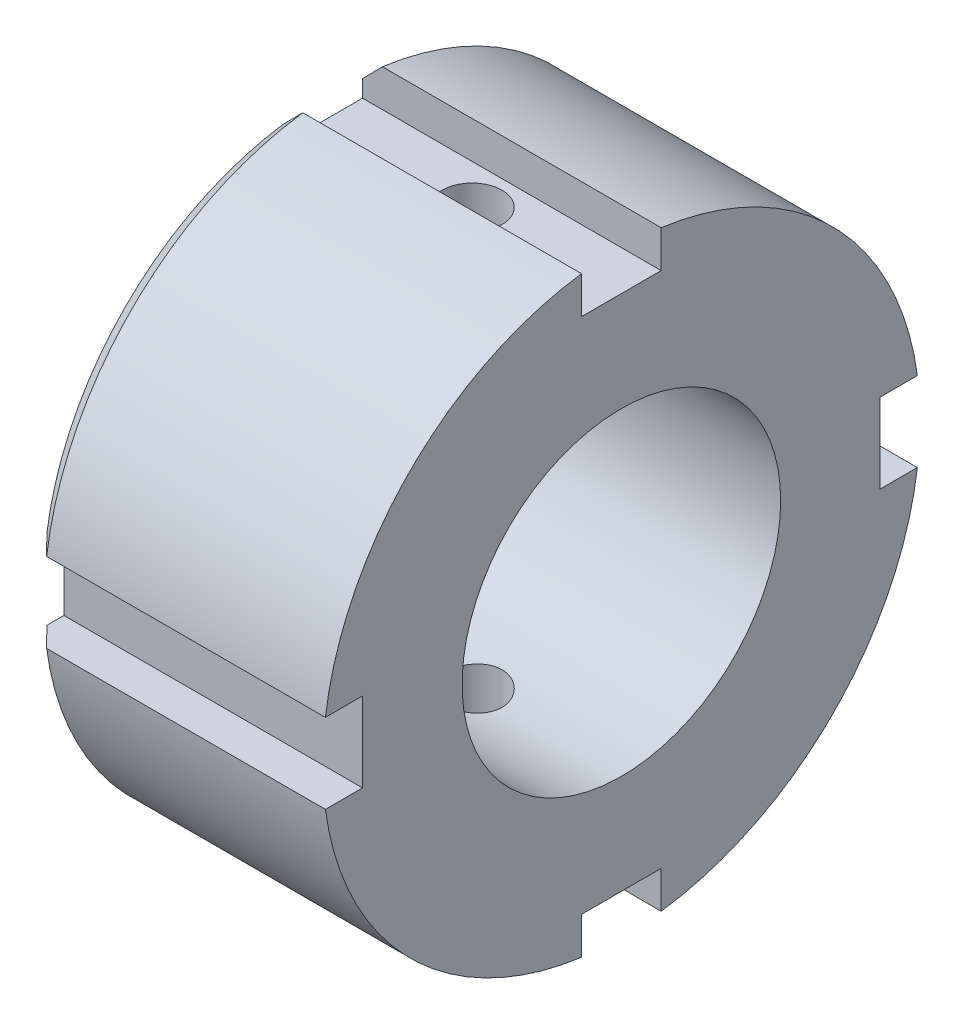
ISO-10303-21;
HEADER;
FILE_DESCRIPTION(('STEP AP214'),'2;1');
FILE_NAME('part.step','',(''),(''),'','','');
FILE_SCHEMA(('AUTOMOTIVE_DESIGN { 1 0 10303 214 1 1 1 1 }'));
ENDSEC;
DATA;
#1=APPLICATION_CONTEXT('core data for automotive mechanical design processes');
#2=APPLICATION_PROTOCOL_DEFINITION('international standard','automotive_design',2000,#1);
#3=PRODUCT_CONTEXT('',#1,'mechanical');
#4=PRODUCT('Part','Part','',(#3));
#5=PRODUCT_RELATED_PRODUCT_CATEGORY('part','',(#4));
#6=PRODUCT_DEFINITION_FORMATION('','',#4);
#7=PRODUCT_DEFINITION_CONTEXT('part definition',#1,'design');
#8=PRODUCT_DEFINITION('design','',#6,#7);
#9=PRODUCT_DEFINITION_SHAPE('','',#8);
#10=(LENGTH_UNIT() NAMED_UNIT(*) SI_UNIT(.MILLI.,.METRE.));
#11=(NAMED_UNIT(*) PLANE_ANGLE_UNIT() SI_UNIT($,.RADIAN.));
#12=(NAMED_UNIT(*) SI_UNIT($,.STERADIAN.) SOLID_ANGLE_UNIT());
#13=UNCERTAINTY_MEASURE_WITH_UNIT(LENGTH_MEASURE(1.E-05),#10,'distance_accuracy_value','');
#14=(GEOMETRIC_REPRESENTATION_CONTEXT(3) GLOBAL_UNCERTAINTY_ASSIGNED_CONTEXT((#13)) GLOBAL_UNIT_ASSIGNED_CONTEXT((#10,
#11,#12)) REPRESENTATION_CONTEXT('',''));
#15=CARTESIAN_POINT('',(0.,0.,0.));
#16=DIRECTION('',(0.,0.,1.));
#17=DIRECTION('',(1.,0.,0.));
#18=AXIS2_PLACEMENT_3D('',#15,#16,#17);
#19=CARTESIAN_POINT('',(0.,0.,0.));
#20=DIRECTION('',(1.,0.,0.));
#21=DIRECTION('',(0.,0.,-1.));
#22=AXIS2_PLACEMENT_3D('',#19,#20,#21);
#23=CYLINDRICAL_SURFACE('',#22,8.);
#24=CARTESIAN_POINT('',(0.,0.,0.));
#25=DIRECTION('',(1.,0.,0.));
#26=DIRECTION('',(0.,0.,-1.));
#27=AXIS2_PLACEMENT_3D('',#24,#25,#26);
#28=CIRCLE('',#27,8.);
#29=CARTESIAN_POINT('',(0.,0.,-8.));
#30=VERTEX_POINT('',#29);
#31=EDGE_CURVE('E344',#30,#30,#28,.T.);
#32=ORIENTED_EDGE('',*,*,#31,.F.);
#33=EDGE_LOOP('',(#32));
#34=FACE_BOUND('',#33,.T.);
#35=CARTESIAN_POINT('',(15.,0.,0.));
#36=DIRECTION('',(1.,0.,0.));
#37=DIRECTION('',(0.,0.,-1.));
#38=AXIS2_PLACEMENT_3D('',#35,#36,#37);
#39=CIRCLE('',#38,8.);
#40=CARTESIAN_POINT('',(15.,0.,-8.));
#41=VERTEX_POINT('',#40);
#42=EDGE_CURVE('E343',#41,#41,#39,.T.);
#43=ORIENTED_EDGE('',*,*,#42,.T.);
#44=EDGE_LOOP('',(#43));
#45=FACE_BOUND('',#44,.T.);
#46=CARTESIAN_POINT('',(7.5,-7.85811682275086,-1.5));
#47=CARTESIAN_POINT('',(7.41654279198826,-7.85811843793493,-1.49999679883246));
#48=CARTESIAN_POINT('',(7.33304405178161,-7.85946079760266,-1.49301126348936));
#49=CARTESIAN_POINT('',(7.16840103841809,-7.86467851014364,-1.46527253251805));
#50=CARTESIAN_POINT('',(7.08725882357252,-7.86855601173205,-1.44450765768477));
#51=CARTESIAN_POINT('',(6.92973492862912,-7.87838976464885,-1.38987035617788));
#52=CARTESIAN_POINT('',(6.85334889069271,-7.88434407905997,-1.35601013954374));
#53=CARTESIAN_POINT('',(6.70734644071319,-7.89765826320959,-1.27617565760366));
#54=CARTESIAN_POINT('',(6.6377295009967,-7.90501802325622,-1.23020233759193));
#55=CARTESIAN_POINT('',(6.50636980080087,-7.92041614838944,-1.12683678942623));
#56=CARTESIAN_POINT('',(6.44472351652827,-7.92846116625679,-1.06932292933092));
#57=CARTESIAN_POINT('',(6.33189561040044,-7.94426457664034,-0.944771778803554));
#58=CARTESIAN_POINT('',(6.28071467557521,-7.95202295031153,-0.877733863624947));
#59=CARTESIAN_POINT('',(6.18990062339948,-7.96645017828405,-0.735403894570165));
#60=CARTESIAN_POINT('',(6.15035846648058,-7.97311028052363,-0.660052840033868));
#61=CARTESIAN_POINT('',(6.08453045772647,-7.9845160863293,-0.503631283250765));
#62=CARTESIAN_POINT('',(6.05824351600978,-7.98926194728334,-0.422561251859508));
#63=CARTESIAN_POINT('',(6.01997045138887,-7.99625755123778,-0.258002746187419));
#64=CARTESIAN_POINT('',(6.00782169407731,-7.99853565976327,-0.17455332324486));
#65=CARTESIAN_POINT('',(5.9976631122996,-8.00043684615594,-0.00677167603538572));
#66=CARTESIAN_POINT('',(5.99965208386094,-8.00006015010697,0.0775604724476677));
#67=CARTESIAN_POINT('',(6.01758777114715,-7.99671633763241,0.243598357899394));
#68=CARTESIAN_POINT('',(6.03335936943001,-7.99378172247214,0.325323760451467));
#69=CARTESIAN_POINT('',(6.07813564939524,-7.98568826333561,0.484947165715473));
#70=CARTESIAN_POINT('',(6.1071408133458,-7.98052933829966,0.562845028826538));
#71=CARTESIAN_POINT('',(6.1777277310583,-7.96851260297339,0.713110065751519));
#72=CARTESIAN_POINT('',(6.2193794879125,-7.96164537590825,0.785443571838531));
#73=CARTESIAN_POINT('',(6.31402566907715,-7.9469714754285,0.922159977214636));
#74=CARTESIAN_POINT('',(6.36702124688758,-7.93916470651164,0.986542066910783));
#75=CARTESIAN_POINT('',(6.48381570298353,-7.92333513680567,1.10656561896904));
#76=CARTESIAN_POINT('',(6.54776778390207,-7.91531085901622,1.16205790757041));
#77=CARTESIAN_POINT('',(6.68414953127862,-7.90006508924621,1.2615517185126));
#78=CARTESIAN_POINT('',(6.75657932176463,-7.89284360901351,1.30555307271182));
#79=CARTESIAN_POINT('',(6.90805827070266,-7.88001893307121,1.38085852224477));
#80=CARTESIAN_POINT('',(6.98711845719064,-7.87441850530261,1.41214093645421));
#81=CARTESIAN_POINT('',(7.1495011841232,-7.86551242396689,1.46093656975056));
#82=CARTESIAN_POINT('',(7.23282324046478,-7.8622065103862,1.47845134901108));
#83=CARTESIAN_POINT('',(7.40001932885588,-7.85831520301005,1.49899672649739));
#84=CARTESIAN_POINT('',(7.48386611556551,-7.85768955816137,1.50224164285859));
#85=CARTESIAN_POINT('',(7.65090345508715,-7.8591219142084,1.49472968881724));
#86=CARTESIAN_POINT('',(7.73409404014808,-7.86117978238611,1.48397351086433));
#87=CARTESIAN_POINT('',(7.89675290305439,-7.86770980063205,1.44894868195882));
#88=CARTESIAN_POINT('',(7.97624625262489,-7.87216186690878,1.42479238583989));
#89=CARTESIAN_POINT('',(8.13005718973016,-7.88296134156619,1.3637722437906));
#90=CARTESIAN_POINT('',(8.20437439531533,-7.88930888963281,1.32690746128795));
#91=CARTESIAN_POINT('',(8.34666761904317,-7.90327577863685,1.2410235311966));
#92=CARTESIAN_POINT('',(8.41456053786607,-7.91090895425315,1.19186899639621));
#93=CARTESIAN_POINT('',(8.54121204021433,-7.926548113681,1.08298344344246));
#94=CARTESIAN_POINT('',(8.59996980155577,-7.93455413096494,1.02325147433084));
#95=CARTESIAN_POINT('',(8.70748376353412,-7.95016624005946,0.893949417870385));
#96=CARTESIAN_POINT('',(8.75609582660596,-7.95776555833305,0.82425853409589));
#97=CARTESIAN_POINT('',(8.84092120617766,-7.97159404810351,0.677574523040139));
#98=CARTESIAN_POINT('',(8.877135000025,-7.97782327234725,0.600581677038528));
#99=CARTESIAN_POINT('',(8.93592009786408,-7.98818057995848,0.441877541578683));
#100=CARTESIAN_POINT('',(8.95856218756141,-7.99231954730142,0.360193213078987));
#101=CARTESIAN_POINT('',(8.98978704828989,-7.99807642083745,0.194096227381569));
#102=CARTESIAN_POINT('',(8.99837129866271,-7.99969459229933,0.10968385821585));
#103=CARTESIAN_POINT('',(9.00118530151844,-8.00022227515441,-0.0580907602505103));
#104=CARTESIAN_POINT('',(8.99563275312953,-7.99917286625032,-0.141449307066269));
#105=CARTESIAN_POINT('',(8.97080757223156,-7.99456866611703,-0.306023369279201));
#106=CARTESIAN_POINT('',(8.95153507125579,-7.99101389890671,-0.38723890521369));
#107=CARTESIAN_POINT('',(8.89990879261628,-7.98179837978045,-0.545106475595486));
#108=CARTESIAN_POINT('',(8.86757818711899,-7.97614135981576,-0.621766319318225));
#109=CARTESIAN_POINT('',(8.79077954634482,-7.96333372068771,-0.768605631316696));
#110=CARTESIAN_POINT('',(8.74631069789335,-7.95618300146483,-0.838784665003272));
#111=CARTESIAN_POINT('',(8.64574854555768,-7.94104779859941,-0.971755027780007));
#112=CARTESIAN_POINT('',(8.5894979661383,-7.93305284591272,-1.03442623539053));
#113=CARTESIAN_POINT('',(8.4672954375073,-7.91719633538833,-1.14951536065485));
#114=CARTESIAN_POINT('',(8.40134120962628,-7.90933480936765,-1.2019308632478));
#115=CARTESIAN_POINT('',(8.26087354529666,-7.89455577425926,-1.29547633945385));
#116=CARTESIAN_POINT('',(8.18628656033236,-7.88764767280729,-1.33649740531872));
#117=CARTESIAN_POINT('',(8.03117421002026,-7.87567084650033,-1.40536132423417));
#118=CARTESIAN_POINT('',(7.95065453341062,-7.87060038649116,-1.43321661638912));
#119=CARTESIAN_POINT('',(7.80824771193409,-7.86393016292125,-1.46929726596176));
#120=CARTESIAN_POINT('',(7.74719427623806,-7.86176310717932,-1.48079105739851));
#121=CARTESIAN_POINT('',(7.62410153157968,-7.85885585595504,-1.49614351076215));
#122=CARTESIAN_POINT('',(7.56206224949967,-7.85811562163283,-1.50000238052127));
#123=CARTESIAN_POINT('',(7.5,-7.85811682275086,-1.5));
#124=B_SPLINE_CURVE_WITH_KNOTS('',3,(#46,#47,#48,#49,#50,#51,#52,#53,#54,#55,#56,#57,#58,#59,
#60,#61,#62,#63,#64,#65,#66,#67,#68,#69,#70,#71,#72,#73,#74,#75,#76,#77,#78,#79,#80,#81,#82,#83,
#84,#85,#86,#87,#88,#89,#90,#91,#92,#93,#94,#95,#96,#97,#98,#99,#100,#101,#102,#103,#104,#105,
#106,#107,#108,#109,#110,#111,#112,#113,#114,#115,#116,#117,#118,#119,#120,#121,#122,#123),
.UNSPECIFIED.,.T.,.F.,(4,2,2,2,2,2,2,2,2,2,2,2,2,2,2,2,2,2,2,2,2,2,2,2,2,2,2,2,2,2,2,2,2,2,2,2,
2,2,4),(0.,0.250144505793186,0.500501302380392,0.750625227978432,1.00072963993908,
1.25362335698691,1.50653367069315,1.76137104348047,2.0161874593964,2.26804275460261,
2.51987660200648,2.76855650598724,3.01724547328424,3.26733691984219,3.51745380911785,
3.77140614764064,4.025362201924,4.27974936118266,4.53410768866488,4.78463248587075,
5.03514489338718,5.28358792315369,5.53204926624317,5.78337862654144,6.03473059394677,
6.28944125495871,6.54414210821705,6.79750269418683,7.0508366166733,7.30029300570138,
7.54974700322167,7.79876026530358,8.0477902135711,8.30038464008744,8.55303847730764,
8.80803001818118,9.06278015749119,9.24880307527214,9.43482092920425),.UNSPECIFIED.);
#125=CARTESIAN_POINT('',(7.5,-7.85811682275086,-1.5));
#126=VERTEX_POINT('',#125);
#127=EDGE_CURVE('E405',#126,#126,#124,.T.);
#128=ORIENTED_EDGE('',*,*,#127,.F.);
#129=EDGE_LOOP('',(#128));
#130=FACE_BOUND('',#129,.T.);
#131=CARTESIAN_POINT('',(7.5,7.85811682275086,-1.5));
#132=CARTESIAN_POINT('',(7.58345720801174,7.85811843793493,-1.49999679883246));
#133=CARTESIAN_POINT('',(7.66695594821839,7.85946079760266,-1.49301126348936));
#134=CARTESIAN_POINT('',(7.83159896158191,7.86467851014364,-1.46527253251805));
#135=CARTESIAN_POINT('',(7.91274117642748,7.86855601173205,-1.44450765768477));
#136=CARTESIAN_POINT('',(8.07026507137087,7.87838976464885,-1.38987035617788));
#137=CARTESIAN_POINT('',(8.14665110930729,7.88434407905997,-1.35601013954374));
#138=CARTESIAN_POINT('',(8.29265355928681,7.89765826320959,-1.27617565760366));
#139=CARTESIAN_POINT('',(8.3622704990033,7.90501802325622,-1.23020233759193));
#140=CARTESIAN_POINT('',(8.49363019919913,7.92041614838944,-1.12683678942623));
#141=CARTESIAN_POINT('',(8.55527648347173,7.92846116625679,-1.06932292933092));
#142=CARTESIAN_POINT('',(8.66810438959956,7.94426457664034,-0.944771778803554));
#143=CARTESIAN_POINT('',(8.71928532442479,7.95202295031153,-0.877733863624948));
#144=CARTESIAN_POINT('',(8.81009937660052,7.96645017828405,-0.735403894570166));
#145=CARTESIAN_POINT('',(8.84964153351942,7.97311028052363,-0.660052840033869));
#146=CARTESIAN_POINT('',(8.91546954227353,7.9845160863293,-0.503631283250765));
#147=CARTESIAN_POINT('',(8.94175648399022,7.98926194728334,-0.422561251859508));
#148=CARTESIAN_POINT('',(8.98002954861113,7.99625755123778,-0.258002746187419));
#149=CARTESIAN_POINT('',(8.99217830592269,7.99853565976327,-0.17455332324486));
#150=CARTESIAN_POINT('',(9.0023368877004,8.00043684615594,-0.00677167603538552));
#151=CARTESIAN_POINT('',(9.00034791613906,8.00006015010697,0.0775604724476677));
#152=CARTESIAN_POINT('',(8.98241222885285,7.99671633763241,0.243598357899394));
#153=CARTESIAN_POINT('',(8.96664063056999,7.99378172247214,0.325323760451467));
#154=CARTESIAN_POINT('',(8.92186435060476,7.98568826333561,0.484947165715473));
#155=CARTESIAN_POINT('',(8.8928591866542,7.98052933829966,0.562845028826538));
#156=CARTESIAN_POINT('',(8.8222722689417,7.96851260297339,0.713110065751519));
#157=CARTESIAN_POINT('',(8.7806205120875,7.96164537590826,0.78544357183853));
#158=CARTESIAN_POINT('',(8.68597433092285,7.9469714754285,0.922159977214635));
#159=CARTESIAN_POINT('',(8.63297875311242,7.93916470651164,0.986542066910783));
#160=CARTESIAN_POINT('',(8.51618429701647,7.92333513680567,1.10656561896904));
#161=CARTESIAN_POINT('',(8.45223221609793,7.91531085901622,1.16205790757041));
#162=CARTESIAN_POINT('',(8.31585046872138,7.90006508924621,1.2615517185126));
#163=CARTESIAN_POINT('',(8.24342067823537,7.89284360901351,1.30555307271182));
#164=CARTESIAN_POINT('',(8.09194172929734,7.88001893307121,1.38085852224477));
#165=CARTESIAN_POINT('',(8.01288154280936,7.87441850530261,1.41214093645421));
#166=CARTESIAN_POINT('',(7.8504988158768,7.86551242396689,1.46093656975056));
#167=CARTESIAN_POINT('',(7.76717675953522,7.8622065103862,1.47845134901108));
#168=CARTESIAN_POINT('',(7.59998067114412,7.85831520301005,1.49899672649739));
#169=CARTESIAN_POINT('',(7.51613388443449,7.85768955816137,1.50224164285858));
#170=CARTESIAN_POINT('',(7.34909654491285,7.8591219142084,1.49472968881724));
#171=CARTESIAN_POINT('',(7.26590595985192,7.86117978238611,1.48397351086433));
#172=CARTESIAN_POINT('',(7.10324709694561,7.86770980063205,1.44894868195883));
#173=CARTESIAN_POINT('',(7.02375374737511,7.87216186690878,1.4247923858399));
#174=CARTESIAN_POINT('',(6.86994281026984,7.88296134156619,1.3637722437906));
#175=CARTESIAN_POINT('',(6.79562560468467,7.88930888963281,1.32690746128795));
#176=CARTESIAN_POINT('',(6.65333238095683,7.90327577863685,1.2410235311966));
#177=CARTESIAN_POINT('',(6.58543946213393,7.91090895425315,1.19186899639621));
#178=CARTESIAN_POINT('',(6.45878795978567,7.926548113681,1.08298344344247));
#179=CARTESIAN_POINT('',(6.40003019844423,7.93455413096494,1.02325147433084));
#180=CARTESIAN_POINT('',(6.29251623646587,7.95016624005946,0.893949417870385));
#181=CARTESIAN_POINT('',(6.24390417339403,7.95776555833305,0.82425853409589));
#182=CARTESIAN_POINT('',(6.15907879382234,7.97159404810351,0.67757452304014));
#183=CARTESIAN_POINT('',(6.122864999975,7.97782327234725,0.600581677038528));
#184=CARTESIAN_POINT('',(6.06407990213592,7.98818057995848,0.441877541578684));
#185=CARTESIAN_POINT('',(6.04143781243859,7.99231954730142,0.360193213078987));
#186=CARTESIAN_POINT('',(6.01021295171011,7.99807642083745,0.19409622738157));
#187=CARTESIAN_POINT('',(6.00162870133729,7.99969459229933,0.10968385821585));
#188=CARTESIAN_POINT('',(5.99881469848156,8.00022227515441,-0.0580907602505096));
#189=CARTESIAN_POINT('',(6.00436724687047,7.99917286625032,-0.141449307066269));
#190=CARTESIAN_POINT('',(6.02919242776843,7.99456866611703,-0.3060233692792));
#191=CARTESIAN_POINT('',(6.04846492874421,7.99101389890671,-0.38723890521369));
#192=CARTESIAN_POINT('',(6.10009120738372,7.98179837978045,-0.545106475595485));
#193=CARTESIAN_POINT('',(6.13242181288101,7.97614135981576,-0.621766319318224));
#194=CARTESIAN_POINT('',(6.20922045365518,7.96333372068771,-0.768605631316694));
#195=CARTESIAN_POINT('',(6.25368930210665,7.95618300146483,-0.838784665003271));
#196=CARTESIAN_POINT('',(6.35425145444232,7.94104779859941,-0.971755027780007));
#197=CARTESIAN_POINT('',(6.4105020338617,7.93305284591272,-1.03442623539053));
#198=CARTESIAN_POINT('',(6.5327045624927,7.91719633538833,-1.14951536065485));
#199=CARTESIAN_POINT('',(6.59865879037372,7.90933480936765,-1.2019308632478));
#200=CARTESIAN_POINT('',(6.73912645470334,7.89455577425926,-1.29547633945385));
#201=CARTESIAN_POINT('',(6.81371343966764,7.88764767280729,-1.33649740531872));
#202=CARTESIAN_POINT('',(6.96882578997974,7.87567084650033,-1.40536132423417));
#203=CARTESIAN_POINT('',(7.04934546658938,7.87060038649116,-1.43321661638912));
#204=CARTESIAN_POINT('',(7.19175228806591,7.86393016292125,-1.46929726596176));
#205=CARTESIAN_POINT('',(7.25280572376194,7.86176310717932,-1.48079105739851));
#206=CARTESIAN_POINT('',(7.37589846842031,7.85885585595504,-1.49614351076215));
#207=CARTESIAN_POINT('',(7.43793775050033,7.85811562163283,-1.50000238052127));
#208=CARTESIAN_POINT('',(7.5,7.85811682275086,-1.5));
#209=B_SPLINE_CURVE_WITH_KNOTS('',3,(#131,#132,#133,#134,#135,#136,#137,#138,#139,#140,#141,
#142,#143,#144,#145,#146,#147,#148,#149,#150,#151,#152,#153,#154,#155,#156,#157,#158,#159,#160,
#161,#162,#163,#164,#165,#166,#167,#168,#169,#170,#171,#172,#173,#174,#175,#176,#177,#178,#179,
#180,#181,#182,#183,#184,#185,#186,#187,#188,#189,#190,#191,#192,#193,#194,#195,#196,#197,#198,
#199,#200,#201,#202,#203,#204,#205,#206,#207,#208),.UNSPECIFIED.,.T.,.F.,(4,2,2,2,2,2,2,2,2,2,2,
2,2,2,2,2,2,2,2,2,2,2,2,2,2,2,2,2,2,2,2,2,2,2,2,2,2,2,4),(0.,0.250144505793186,
0.500501302380392,0.750625227978432,1.00072963993908,1.25362335698691,1.50653367069315,
1.76137104348047,2.0161874593964,2.26804275460261,2.51987660200648,2.76855650598724,
3.01724547328424,3.26733691984219,3.51745380911785,3.77140614764064,4.025362201924,
4.27974936118266,4.53410768866488,4.78463248587075,5.03514489338718,5.28358792315368,
5.53204926624317,5.78337862654143,6.03473059394677,6.28944125495871,6.54414210821705,
6.79750269418683,7.0508366166733,7.30029300570138,7.54974700322167,7.79876026530358,
8.0477902135711,8.30038464008745,8.55303847730765,8.80803001818118,9.06278015749119,
9.24880307527214,9.43482092920425),.UNSPECIFIED.);
#210=CARTESIAN_POINT('',(7.5,7.85811682275086,-1.5));
#211=VERTEX_POINT('',#210);
#212=EDGE_CURVE('E271',#211,#211,#209,.T.);
#213=ORIENTED_EDGE('',*,*,#212,.F.);
#214=EDGE_LOOP('',(#213));
#215=FACE_BOUND('',#214,.T.);
#216=ADVANCED_FACE('F45',(#34,#45,#130,#215),#23,.F.);
#217=CARTESIAN_POINT('',(15.,0.,0.));
#218=DIRECTION('',(-1.,0.,0.));
#219=DIRECTION('',(0.,0.,1.));
#220=AXIS2_PLACEMENT_3D('',#217,#218,#219);
#221=CYLINDRICAL_SURFACE('',#220,15.);
#222=CARTESIAN_POINT('',(1.,0.,0.));
#223=DIRECTION('',(1.,0.,0.));
#224=DIRECTION('',(0.,0.,-1.));
#225=AXIS2_PLACEMENT_3D('',#222,#223,#224);
#226=CIRCLE('',#225,15.);
#227=CARTESIAN_POINT('',(1.,14.8660687473185,2.));
#228=VERTEX_POINT('',#227);
#229=CARTESIAN_POINT('',(1.,1.99999999999995,14.8660687473185));
#230=VERTEX_POINT('',#229);
#231=EDGE_CURVE('E358',#228,#230,#226,.T.);
#232=ORIENTED_EDGE('',*,*,#231,.T.);
#233=DIRECTION('',(-1.,0.,0.));
#234=VECTOR('',#233,1.);
#235=CARTESIAN_POINT('',(15.,1.99999999999995,14.8660687473185));
#236=LINE('',#235,#234);
#237=CARTESIAN_POINT('',(15.,1.99999999999995,14.8660687473185));
#238=VERTEX_POINT('',#237);
#239=EDGE_CURVE('E301',#230,#238,#236,.F.);
#240=ORIENTED_EDGE('',*,*,#239,.T.);
#241=CARTESIAN_POINT('',(15.,0.,0.));
#242=DIRECTION('',(1.,0.,0.));
#243=DIRECTION('',(0.,0.,-1.));
#244=AXIS2_PLACEMENT_3D('',#241,#242,#243);
#245=CIRCLE('',#244,15.);
#246=CARTESIAN_POINT('',(15.,14.8660687473185,2.));
#247=VERTEX_POINT('',#246);
#248=EDGE_CURVE('E352',#247,#238,#245,.T.);
#249=ORIENTED_EDGE('',*,*,#248,.F.);
#250=DIRECTION('',(-1.,0.,0.));
#251=VECTOR('',#250,1.);
#252=CARTESIAN_POINT('',(15.,14.8660687473185,2.));
#253=LINE('',#252,#251);
#254=EDGE_CURVE('E332',#247,#228,#253,.T.);
#255=ORIENTED_EDGE('',*,*,#254,.T.);
#256=EDGE_LOOP('',(#232,#240,#249,#255));
#257=FACE_BOUND('',#256,.T.);
#258=ADVANCED_FACE('F399',(#257),#221,.T.);
#259=CARTESIAN_POINT('',(15.,-2.00000000000005,14.8660687473185));
#260=VERTEX_POINT('',#259);
#261=CARTESIAN_POINT('',(15.,-14.8660687473185,2.));
#262=VERTEX_POINT('',#261);
#263=EDGE_CURVE('E357',#260,#262,#245,.T.);
#264=ORIENTED_EDGE('',*,*,#263,.F.);
#265=DIRECTION('',(-1.,0.,0.));
#266=VECTOR('',#265,1.);
#267=CARTESIAN_POINT('',(15.,-2.00000000000005,14.8660687473185));
#268=LINE('',#267,#266);
#269=CARTESIAN_POINT('',(1.,-2.00000000000005,14.8660687473185));
#270=VERTEX_POINT('',#269);
#271=EDGE_CURVE('E297',#260,#270,#268,.T.);
#272=ORIENTED_EDGE('',*,*,#271,.T.);
#273=CARTESIAN_POINT('',(1.,-14.8660687473185,2.));
#274=VERTEX_POINT('',#273);
#275=EDGE_CURVE('E363',#270,#274,#226,.T.);
#276=ORIENTED_EDGE('',*,*,#275,.T.);
#277=DIRECTION('',(-1.,0.,0.));
#278=VECTOR('',#277,1.);
#279=CARTESIAN_POINT('',(15.,-14.8660687473185,2.));
#280=LINE('',#279,#278);
#281=EDGE_CURVE('E293',#274,#262,#280,.F.);
#282=ORIENTED_EDGE('',*,*,#281,.T.);
#283=EDGE_LOOP('',(#264,#272,#276,#282));
#284=FACE_BOUND('',#283,.T.);
#285=ADVANCED_FACE('F554',(#284),#221,.T.);
#286=CARTESIAN_POINT('',(15.,-14.8660687473185,-2.));
#287=VERTEX_POINT('',#286);
#288=CARTESIAN_POINT('',(15.,-1.99999999999985,-14.8660687473185));
#289=VERTEX_POINT('',#288);
#290=EDGE_CURVE('E501',#287,#289,#245,.T.);
#291=ORIENTED_EDGE('',*,*,#290,.F.);
#292=DIRECTION('',(-1.,0.,0.));
#293=VECTOR('',#292,1.);
#294=CARTESIAN_POINT('',(15.,-14.8660687473185,-2.));
#295=LINE('',#294,#293);
#296=CARTESIAN_POINT('',(1.,-14.8660687473185,-2.));
#297=VERTEX_POINT('',#296);
#298=EDGE_CURVE('E289',#287,#297,#295,.T.);
#299=ORIENTED_EDGE('',*,*,#298,.T.);
#300=CARTESIAN_POINT('',(1.,-1.99999999999985,-14.8660687473185));
#301=VERTEX_POINT('',#300);
#302=EDGE_CURVE('E499',#297,#301,#226,.T.);
#303=ORIENTED_EDGE('',*,*,#302,.T.);
#304=DIRECTION('',(-1.,0.,0.));
#305=VECTOR('',#304,1.);
#306=CARTESIAN_POINT('',(15.,-1.99999999999985,-14.8660687473185));
#307=LINE('',#306,#305);
#308=EDGE_CURVE('E285',#301,#289,#307,.F.);
#309=ORIENTED_EDGE('',*,*,#308,.T.);
#310=EDGE_LOOP('',(#291,#299,#303,#309));
#311=FACE_BOUND('',#310,.T.);
#312=ADVANCED_FACE('F498',(#311),#221,.T.);
#313=CARTESIAN_POINT('',(1.,0.,0.));
#314=DIRECTION('',(1.,0.,0.));
#315=DIRECTION('',(0.,0.,-1.));
#316=AXIS2_PLACEMENT_3D('',#313,#314,#315);
#317=CONICAL_SURFACE('',#316,15.,0.78539816339745);
#318=CARTESIAN_POINT('',(3.23626797749979,1.99999999999994,17.1198403553358));
#319=CARTESIAN_POINT('',(2.77949257358208,1.99999999999994,16.6599502143616));
#320=CARTESIAN_POINT('',(2.32283355598238,1.99999999999995,16.199944379221));
#321=CARTESIAN_POINT('',(1.40983903079534,1.99999999999995,15.2796126300725));
#322=CARTESIAN_POINT('',(0.95350352291392,1.99999999999995,14.8192867163562));
#323=CARTESIAN_POINT('',(0.041245708928601,1.99999999999995,13.8982250668306));
#324=CARTESIAN_POINT('',(-0.414676596981592,1.99999999999996,13.4374893308294));
#325=CARTESIAN_POINT('',(-1.32594517655886,1.99999999999996,12.5154477831824));
#326=CARTESIAN_POINT('',(-1.78129144969422,1.99999999999996,12.0541419710112));
#327=CARTESIAN_POINT('',(-2.23626797749978,1.99999999999996,11.5924713110362));
#328=B_SPLINE_CURVE_WITH_KNOTS('',3,(#318,#319,#320,#321,#322,#323,#324,#325,#326,#327),
.UNSPECIFIED.,.F.,.F.,(4,2,2,2,4),(0.,1.94455256503318,3.88910336001572,5.8336550660895,
7.77820856578055),.UNSPECIFIED.);
#329=CARTESIAN_POINT('',(0.,1.99999999999995,13.856406460551));
#330=VERTEX_POINT('',#329);
#331=EDGE_CURVE('E11',#230,#330,#328,.T.);
#332=ORIENTED_EDGE('',*,*,#331,.F.);
#333=ORIENTED_EDGE('',*,*,#231,.F.);
#334=CARTESIAN_POINT('',(-2.23626797749979,11.5924713110362,2.));
#335=CARTESIAN_POINT('',(-1.78129144969423,12.0541419710112,2.));
#336=CARTESIAN_POINT('',(-1.32594517655886,12.5154477831824,2.));
#337=CARTESIAN_POINT('',(-0.414676596981595,13.4374893308294,2.));
#338=CARTESIAN_POINT('',(0.0412457089285992,13.8982250668306,2.));
#339=CARTESIAN_POINT('',(0.953503522913919,14.8192867163562,2.));
#340=CARTESIAN_POINT('',(1.40983903079535,15.2796126300725,2.));
#341=CARTESIAN_POINT('',(2.32283355598238,16.199944379221,2.));
#342=CARTESIAN_POINT('',(2.77949257358209,16.6599502143616,2.));
#343=CARTESIAN_POINT('',(3.23626797749979,17.1198403553358,2.));
#344=B_SPLINE_CURVE_WITH_KNOTS('',3,(#334,#335,#336,#337,#338,#339,#340,#341,#342,#343),
.UNSPECIFIED.,.F.,.F.,(4,2,2,2,4),(0.,1.94455349969105,3.88910520576483,5.83365600074738,
7.77820856578056),.UNSPECIFIED.);
#345=CARTESIAN_POINT('',(0.,13.856406460551,2.));
#346=VERTEX_POINT('',#345);
#347=EDGE_CURVE('E368',#346,#228,#344,.T.);
#348=ORIENTED_EDGE('',*,*,#347,.F.);
#349=CARTESIAN_POINT('',(0.,0.,0.));
#350=DIRECTION('',(1.,0.,0.));
#351=DIRECTION('',(0.,0.,-1.));
#352=AXIS2_PLACEMENT_3D('',#349,#350,#351);
#353=CIRCLE('',#352,14.);
#354=EDGE_CURVE('E362',#330,#346,#353,.F.);
#355=ORIENTED_EDGE('',*,*,#354,.F.);
#356=EDGE_LOOP('',(#332,#333,#348,#355));
#357=FACE_BOUND('',#356,.T.);
#358=ADVANCED_FACE('F529',(#357),#317,.T.);
#359=CARTESIAN_POINT('',(-2.2362679774998,-2.00000000000004,11.5924713110362));
#360=CARTESIAN_POINT('',(-1.78129144969423,-2.00000000000004,12.0541419710112));
#361=CARTESIAN_POINT('',(-1.32594517655887,-2.00000000000004,12.5154477831824));
#362=CARTESIAN_POINT('',(-0.414676596981598,-2.00000000000004,13.4374893308294));
#363=CARTESIAN_POINT('',(0.0412457089285967,-2.00000000000005,13.8982250668306));
#364=CARTESIAN_POINT('',(0.953503522913919,-2.00000000000005,14.8192867163562));
#365=CARTESIAN_POINT('',(1.40983903079535,-2.00000000000005,15.2796126300724));
#366=CARTESIAN_POINT('',(2.32283355598238,-2.00000000000005,16.199944379221));
#367=CARTESIAN_POINT('',(2.77949257358209,-2.00000000000006,16.6599502143616));
#368=CARTESIAN_POINT('',(3.2362679774998,-2.00000000000006,17.1198403553358));
#369=B_SPLINE_CURVE_WITH_KNOTS('',3,(#359,#360,#361,#362,#363,#364,#365,#366,#367,#368),
.UNSPECIFIED.,.F.,.F.,(4,2,2,2,4),(0.,1.94455349969106,3.88910520576484,5.83365600074739,
7.77820856578058),.UNSPECIFIED.);
#370=CARTESIAN_POINT('',(0.,-2.00000000000005,13.856406460551));
#371=VERTEX_POINT('',#370);
#372=EDGE_CURVE('E57',#371,#270,#369,.T.);
#373=ORIENTED_EDGE('',*,*,#372,.F.);
#374=CARTESIAN_POINT('',(0.,-13.856406460551,2.));
#375=VERTEX_POINT('',#374);
#376=EDGE_CURVE('E207',#375,#371,#353,.F.);
#377=ORIENTED_EDGE('',*,*,#376,.F.);
#378=CARTESIAN_POINT('',(3.23626797749979,-17.1198403553358,2.));
#379=CARTESIAN_POINT('',(2.77949257358209,-16.6599502143616,2.));
#380=CARTESIAN_POINT('',(2.32283355598238,-16.199944379221,2.));
#381=CARTESIAN_POINT('',(1.40983903079535,-15.2796126300725,2.));
#382=CARTESIAN_POINT('',(0.953503522913921,-14.8192867163562,2.));
#383=CARTESIAN_POINT('',(0.0412457089286005,-13.8982250668306,2.));
#384=CARTESIAN_POINT('',(-0.414676596981594,-13.4374893308294,2.));
#385=CARTESIAN_POINT('',(-1.32594517655886,-12.5154477831824,2.));
#386=CARTESIAN_POINT('',(-1.78129144969423,-12.0541419710112,2.));
#387=CARTESIAN_POINT('',(-2.23626797749979,-11.5924713110362,2.));
#388=B_SPLINE_CURVE_WITH_KNOTS('',3,(#378,#379,#380,#381,#382,#383,#384,#385,#386,#387),
.UNSPECIFIED.,.F.,.F.,(4,2,2,2,4),(0.,1.94455256503318,3.88910336001573,5.83365506608951,
7.77820856578056),.UNSPECIFIED.);
#389=EDGE_CURVE('E438',#274,#375,#388,.T.);
#390=ORIENTED_EDGE('',*,*,#389,.F.);
#391=ORIENTED_EDGE('',*,*,#275,.F.);
#392=EDGE_LOOP('',(#373,#377,#390,#391));
#393=FACE_BOUND('',#392,.T.);
#394=ADVANCED_FACE('F551',(#393),#317,.T.);
#395=CARTESIAN_POINT('',(-2.23626797749979,-11.5924713110362,-2.));
#396=CARTESIAN_POINT('',(-1.78129144969423,-12.0541419710112,-2.));
#397=CARTESIAN_POINT('',(-1.32594517655887,-12.5154477831824,-2.));
#398=CARTESIAN_POINT('',(-0.414676596981596,-13.4374893308294,-2.));
#399=CARTESIAN_POINT('',(0.0412457089285981,-13.8982250668306,-2.));
#400=CARTESIAN_POINT('',(0.953503522913918,-14.8192867163562,-2.));
#401=CARTESIAN_POINT('',(1.40983903079534,-15.2796126300724,-2.));
#402=CARTESIAN_POINT('',(2.32283355598238,-16.199944379221,-2.));
#403=CARTESIAN_POINT('',(2.77949257358209,-16.6599502143616,-2.));
#404=CARTESIAN_POINT('',(3.23626797749979,-17.1198403553358,-2.));
#405=B_SPLINE_CURVE_WITH_KNOTS('',3,(#395,#396,#397,#398,#399,#400,#401,#402,#403,#404),
.UNSPECIFIED.,.F.,.F.,(4,2,2,2,4),(0.,1.94455349969105,3.88910520576483,5.83365600074738,
7.77820856578056),.UNSPECIFIED.);
#406=CARTESIAN_POINT('',(0.,-13.856406460551,-2.));
#407=VERTEX_POINT('',#406);
#408=EDGE_CURVE('E450',#407,#297,#405,.T.);
#409=ORIENTED_EDGE('',*,*,#408,.F.);
#410=CARTESIAN_POINT('',(0.,-1.99999999999986,-13.856406460551));
#411=VERTEX_POINT('',#410);
#412=EDGE_CURVE('E369',#411,#407,#353,.F.);
#413=ORIENTED_EDGE('',*,*,#412,.F.);
#414=CARTESIAN_POINT('',(3.23626797749977,-1.99999999999982,-17.1198403553358));
#415=CARTESIAN_POINT('',(2.77949257358207,-1.99999999999983,-16.6599502143616));
#416=CARTESIAN_POINT('',(2.32283355598237,-1.99999999999983,-16.199944379221));
#417=CARTESIAN_POINT('',(1.40983903079534,-1.99999999999984,-15.2796126300725));
#418=CARTESIAN_POINT('',(0.953503522913916,-1.99999999999985,-14.8192867163562));
#419=CARTESIAN_POINT('',(0.0412457089286024,-1.99999999999986,-13.8982250668306));
#420=CARTESIAN_POINT('',(-0.414676596981589,-1.99999999999986,-13.4374893308294));
#421=CARTESIAN_POINT('',(-1.32594517655885,-1.99999999999987,-12.5154477831824));
#422=CARTESIAN_POINT('',(-1.78129144969422,-1.99999999999988,-12.0541419710113));
#423=CARTESIAN_POINT('',(-2.23626797749977,-1.99999999999988,-11.5924713110362));
#424=B_SPLINE_CURVE_WITH_KNOTS('',3,(#414,#415,#416,#417,#418,#419,#420,#421,#422,#423),
.UNSPECIFIED.,.F.,.F.,(4,2,2,2,4),(0.,1.94455256503317,3.8891033600157,5.83365506608947,
7.77820856578051),.UNSPECIFIED.);
#425=EDGE_CURVE('E480',#301,#411,#424,.T.);
#426=ORIENTED_EDGE('',*,*,#425,.F.);
#427=ORIENTED_EDGE('',*,*,#302,.F.);
#428=EDGE_LOOP('',(#409,#413,#426,#427));
#429=FACE_BOUND('',#428,.T.);
#430=ADVANCED_FACE('F502',(#429),#317,.T.);
#431=CARTESIAN_POINT('',(15.,2.00000000000015,-14.8660687473185));
#432=VERTEX_POINT('',#431);
#433=CARTESIAN_POINT('',(15.,14.8660687473185,-2.));
#434=VERTEX_POINT('',#433);
#435=EDGE_CURVE('E348',#432,#434,#245,.T.);
#436=ORIENTED_EDGE('',*,*,#435,.F.);
#437=DIRECTION('',(-1.,0.,0.));
#438=VECTOR('',#437,1.);
#439=CARTESIAN_POINT('',(15.,2.00000000000015,-14.8660687473185));
#440=LINE('',#439,#438);
#441=CARTESIAN_POINT('',(1.,2.00000000000015,-14.8660687473185));
#442=VERTEX_POINT('',#441);
#443=EDGE_CURVE('E225',#432,#442,#440,.T.);
#444=ORIENTED_EDGE('',*,*,#443,.T.);
#445=CARTESIAN_POINT('',(1.,14.8660687473185,-2.));
#446=VERTEX_POINT('',#445);
#447=EDGE_CURVE('E356',#442,#446,#226,.T.);
#448=ORIENTED_EDGE('',*,*,#447,.T.);
#449=DIRECTION('',(-1.,0.,0.));
#450=VECTOR('',#449,1.);
#451=CARTESIAN_POINT('',(15.,14.8660687473185,-2.));
#452=LINE('',#451,#450);
#453=EDGE_CURVE('E339',#446,#434,#452,.F.);
#454=ORIENTED_EDGE('',*,*,#453,.T.);
#455=EDGE_LOOP('',(#436,#444,#448,#454));
#456=FACE_BOUND('',#455,.T.);
#457=ADVANCED_FACE('F511',(#456),#221,.T.);
#458=CARTESIAN_POINT('',(15.,0.,0.));
#459=DIRECTION('',(1.,0.,0.));
#460=DIRECTION('',(0.,0.,-1.));
#461=AXIS2_PLACEMENT_3D('',#458,#459,#460);
#462=PLANE('',#461);
#463=DIRECTION('',(0.,0.,1.));
#464=VECTOR('',#463,1.);
#465=CARTESIAN_POINT('',(15.,1.99999999999994,17.));
#466=LINE('',#465,#464);
#467=CARTESIAN_POINT('',(15.,1.99999999999996,13.));
#468=VERTEX_POINT('',#467);
#469=EDGE_CURVE('E216',#468,#238,#466,.T.);
#470=ORIENTED_EDGE('',*,*,#469,.F.);
#471=DIRECTION('',(0.,1.,0.));
#472=VECTOR('',#471,1.);
#473=CARTESIAN_POINT('',(15.,-2.00000000000004,13.));
#474=LINE('',#473,#472);
#475=CARTESIAN_POINT('',(15.,-2.00000000000004,13.));
#476=VERTEX_POINT('',#475);
#477=EDGE_CURVE('E212',#476,#468,#474,.T.);
#478=ORIENTED_EDGE('',*,*,#477,.F.);
#479=DIRECTION('',(0.,0.,-1.));
#480=VECTOR('',#479,1.);
#481=CARTESIAN_POINT('',(15.,-2.00000000000006,17.));
#482=LINE('',#481,#480);
#483=EDGE_CURVE('E187',#260,#476,#482,.T.);
#484=ORIENTED_EDGE('',*,*,#483,.F.);
#485=ORIENTED_EDGE('',*,*,#263,.T.);
#486=DIRECTION('',(0.,-1.,0.));
#487=VECTOR('',#486,1.);
#488=CARTESIAN_POINT('',(15.,-17.,2.));
#489=LINE('',#488,#487);
#490=CARTESIAN_POINT('',(15.,-13.,2.));
#491=VERTEX_POINT('',#490);
#492=EDGE_CURVE('E238',#491,#262,#489,.T.);
#493=ORIENTED_EDGE('',*,*,#492,.F.);
#494=DIRECTION('',(0.,0.,1.));
#495=VECTOR('',#494,1.);
#496=CARTESIAN_POINT('',(15.,-13.,-2.));
#497=LINE('',#496,#495);
#498=CARTESIAN_POINT('',(15.,-13.,-2.));
#499=VERTEX_POINT('',#498);
#500=EDGE_CURVE('E230',#499,#491,#497,.T.);
#501=ORIENTED_EDGE('',*,*,#500,.F.);
#502=DIRECTION('',(0.,1.,0.));
#503=VECTOR('',#502,1.);
#504=CARTESIAN_POINT('',(15.,-17.,-2.));
#505=LINE('',#504,#503);
#506=EDGE_CURVE('E241',#287,#499,#505,.T.);
#507=ORIENTED_EDGE('',*,*,#506,.F.);
#508=ORIENTED_EDGE('',*,*,#290,.T.);
#509=DIRECTION('',(0.,0.,-1.));
#510=VECTOR('',#509,1.);
#511=CARTESIAN_POINT('',(15.,-1.99999999999982,-17.));
#512=LINE('',#511,#510);
#513=CARTESIAN_POINT('',(15.,-1.99999999999987,-13.));
#514=VERTEX_POINT('',#513);
#515=EDGE_CURVE('E267',#514,#289,#512,.T.);
#516=ORIENTED_EDGE('',*,*,#515,.F.);
#517=DIRECTION('',(0.,-1.,0.));
#518=VECTOR('',#517,1.);
#519=CARTESIAN_POINT('',(15.,2.00000000000013,-13.));
#520=LINE('',#519,#518);
#521=CARTESIAN_POINT('',(15.,2.00000000000013,-13.));
#522=VERTEX_POINT('',#521);
#523=EDGE_CURVE('E258',#522,#514,#520,.T.);
#524=ORIENTED_EDGE('',*,*,#523,.F.);
#525=DIRECTION('',(0.,0.,1.));
#526=VECTOR('',#525,1.);
#527=CARTESIAN_POINT('',(15.,2.00000000000018,-17.));
#528=LINE('',#527,#526);
#529=EDGE_CURVE('E270',#432,#522,#528,.T.);
#530=ORIENTED_EDGE('',*,*,#529,.F.);
#531=ORIENTED_EDGE('',*,*,#435,.T.);
#532=DIRECTION('',(0.,1.,0.));
#533=VECTOR('',#532,1.);
#534=CARTESIAN_POINT('',(15.,17.,-2.));
#535=LINE('',#534,#533);
#536=CARTESIAN_POINT('',(15.,13.,-2.));
#537=VERTEX_POINT('',#536);
#538=EDGE_CURVE('E305',#537,#434,#535,.T.);
#539=ORIENTED_EDGE('',*,*,#538,.F.);
#540=DIRECTION('',(0.,0.,-1.));
#541=VECTOR('',#540,1.);
#542=CARTESIAN_POINT('',(15.,13.,2.));
#543=LINE('',#542,#541);
#544=CARTESIAN_POINT('',(15.,13.,2.));
#545=VERTEX_POINT('',#544);
#546=EDGE_CURVE('E311',#545,#537,#543,.T.);
#547=ORIENTED_EDGE('',*,*,#546,.F.);
#548=DIRECTION('',(0.,-1.,0.));
#549=VECTOR('',#548,1.);
#550=CARTESIAN_POINT('',(15.,17.,2.));
#551=LINE('',#550,#549);
#552=EDGE_CURVE('E323',#247,#545,#551,.T.);
#553=ORIENTED_EDGE('',*,*,#552,.F.);
#554=ORIENTED_EDGE('',*,*,#248,.T.);
#555=EDGE_LOOP('',(#470,#478,#484,#485,#493,#501,#507,#508,#516,#524,#530,#531,#539,#547,#553,#554));
#556=FACE_BOUND('',#555,.T.);
#557=ORIENTED_EDGE('',*,*,#42,.F.);
#558=EDGE_LOOP('',(#557));
#559=FACE_BOUND('',#558,.T.);
#560=ADVANCED_FACE('F401',(#556,#559),#462,.T.);
#561=CARTESIAN_POINT('',(0.,0.,0.));
#562=DIRECTION('',(1.,0.,0.));
#563=DIRECTION('',(0.,0.,-1.));
#564=AXIS2_PLACEMENT_3D('',#561,#562,#563);
#565=PLANE('',#564);
#566=DIRECTION('',(0.,1.,0.));
#567=VECTOR('',#566,1.);
#568=CARTESIAN_POINT('',(0.,-2.00000000000004,13.));
#569=LINE('',#568,#567);
#570=CARTESIAN_POINT('',(0.,-2.00000000000004,13.));
#571=VERTEX_POINT('',#570);
#572=CARTESIAN_POINT('',(0.,1.99999999999996,13.));
#573=VERTEX_POINT('',#572);
#574=EDGE_CURVE('E193',#571,#573,#569,.T.);
#575=ORIENTED_EDGE('',*,*,#574,.T.);
#576=DIRECTION('',(0.,0.,1.));
#577=VECTOR('',#576,1.);
#578=CARTESIAN_POINT('',(0.,1.99999999999994,17.));
#579=LINE('',#578,#577);
#580=EDGE_CURVE('E209',#573,#330,#579,.T.);
#581=ORIENTED_EDGE('',*,*,#580,.T.);
#582=ORIENTED_EDGE('',*,*,#354,.T.);
#583=DIRECTION('',(0.,-1.,0.));
#584=VECTOR('',#583,1.);
#585=CARTESIAN_POINT('',(0.,17.,2.));
#586=LINE('',#585,#584);
#587=CARTESIAN_POINT('',(0.,13.,2.));
#588=VERTEX_POINT('',#587);
#589=EDGE_CURVE('E310',#346,#588,#586,.T.);
#590=ORIENTED_EDGE('',*,*,#589,.T.);
#591=DIRECTION('',(0.,0.,-1.));
#592=VECTOR('',#591,1.);
#593=CARTESIAN_POINT('',(0.,13.,2.));
#594=LINE('',#593,#592);
#595=CARTESIAN_POINT('',(0.,13.,-2.));
#596=VERTEX_POINT('',#595);
#597=EDGE_CURVE('E315',#588,#596,#594,.T.);
#598=ORIENTED_EDGE('',*,*,#597,.T.);
#599=DIRECTION('',(0.,1.,0.));
#600=VECTOR('',#599,1.);
#601=CARTESIAN_POINT('',(0.,17.,-2.));
#602=LINE('',#601,#600);
#603=CARTESIAN_POINT('',(0.,13.856406460551,-2.));
#604=VERTEX_POINT('',#603);
#605=EDGE_CURVE('E306',#596,#604,#602,.T.);
#606=ORIENTED_EDGE('',*,*,#605,.T.);
#607=CARTESIAN_POINT('',(0.,2.00000000000014,-13.856406460551));
#608=VERTEX_POINT('',#607);
#609=EDGE_CURVE('E364',#604,#608,#353,.F.);
#610=ORIENTED_EDGE('',*,*,#609,.T.);
#611=DIRECTION('',(0.,0.,1.));
#612=VECTOR('',#611,1.);
#613=CARTESIAN_POINT('',(0.,2.00000000000018,-17.));
#614=LINE('',#613,#612);
#615=CARTESIAN_POINT('',(0.,2.00000000000013,-13.));
#616=VERTEX_POINT('',#615);
#617=EDGE_CURVE('E257',#608,#616,#614,.T.);
#618=ORIENTED_EDGE('',*,*,#617,.T.);
#619=DIRECTION('',(0.,-1.,0.));
#620=VECTOR('',#619,1.);
#621=CARTESIAN_POINT('',(0.,2.00000000000013,-13.));
#622=LINE('',#621,#620);
#623=CARTESIAN_POINT('',(0.,-1.99999999999987,-13.));
#624=VERTEX_POINT('',#623);
#625=EDGE_CURVE('E262',#616,#624,#622,.T.);
#626=ORIENTED_EDGE('',*,*,#625,.T.);
#627=DIRECTION('',(0.,0.,-1.));
#628=VECTOR('',#627,1.);
#629=CARTESIAN_POINT('',(0.,-1.99999999999982,-17.));
#630=LINE('',#629,#628);
#631=EDGE_CURVE('E253',#624,#411,#630,.T.);
#632=ORIENTED_EDGE('',*,*,#631,.T.);
#633=ORIENTED_EDGE('',*,*,#412,.T.);
#634=DIRECTION('',(0.,1.,0.));
#635=VECTOR('',#634,1.);
#636=CARTESIAN_POINT('',(0.,-17.,-2.));
#637=LINE('',#636,#635);
#638=CARTESIAN_POINT('',(0.,-13.,-2.));
#639=VERTEX_POINT('',#638);
#640=EDGE_CURVE('E72',#407,#639,#637,.T.);
#641=ORIENTED_EDGE('',*,*,#640,.T.);
#642=DIRECTION('',(0.,0.,1.));
#643=VECTOR('',#642,1.);
#644=CARTESIAN_POINT('',(0.,-13.,-2.));
#645=LINE('',#644,#643);
#646=CARTESIAN_POINT('',(0.,-13.,2.));
#647=VERTEX_POINT('',#646);
#648=EDGE_CURVE('E233',#639,#647,#645,.T.);
#649=ORIENTED_EDGE('',*,*,#648,.T.);
#650=DIRECTION('',(0.,-1.,0.));
#651=VECTOR('',#650,1.);
#652=CARTESIAN_POINT('',(0.,-17.,2.));
#653=LINE('',#652,#651);
#654=EDGE_CURVE('E227',#647,#375,#653,.T.);
#655=ORIENTED_EDGE('',*,*,#654,.T.);
#656=ORIENTED_EDGE('',*,*,#376,.T.);
#657=DIRECTION('',(0.,0.,-1.));
#658=VECTOR('',#657,1.);
#659=CARTESIAN_POINT('',(0.,-2.00000000000006,17.));
#660=LINE('',#659,#658);
#661=EDGE_CURVE('E64',#371,#571,#660,.T.);
#662=ORIENTED_EDGE('',*,*,#661,.T.);
#663=EDGE_LOOP('',(#575,#581,#582,#590,#598,#606,#610,#618,#626,#632,#633,#641,#649,#655,#656,#662));
#664=FACE_BOUND('',#663,.T.);
#665=ORIENTED_EDGE('',*,*,#31,.T.);
#666=EDGE_LOOP('',(#665));
#667=FACE_BOUND('',#666,.T.);
#668=ADVANCED_FACE('F203',(#664,#667),#565,.F.);
#669=CARTESIAN_POINT('',(-2.23626797749981,2.00000000000012,-11.5924713110361));
#670=CARTESIAN_POINT('',(-1.78129144969424,2.00000000000012,-12.0541419710112));
#671=CARTESIAN_POINT('',(-1.32594517655888,2.00000000000013,-12.5154477831824));
#672=CARTESIAN_POINT('',(-0.414676596981602,2.00000000000014,-13.4374893308294));
#673=CARTESIAN_POINT('',(0.0412457089285957,2.00000000000014,-13.8982250668306));
#674=CARTESIAN_POINT('',(0.953503522913922,2.00000000000015,-14.8192867163562));
#675=CARTESIAN_POINT('',(1.40983903079535,2.00000000000016,-15.2796126300724));
#676=CARTESIAN_POINT('',(2.32283355598239,2.00000000000017,-16.199944379221));
#677=CARTESIAN_POINT('',(2.77949257358211,2.00000000000017,-16.6599502143616));
#678=CARTESIAN_POINT('',(3.23626797749981,2.00000000000018,-17.1198403553358));
#679=B_SPLINE_CURVE_WITH_KNOTS('',3,(#669,#670,#671,#672,#673,#674,#675,#676,#677,#678),
.UNSPECIFIED.,.F.,.F.,(4,2,2,2,4),(0.,1.94455349969107,3.88910520576486,5.83365600074742,
7.77820856578062),.UNSPECIFIED.);
#680=EDGE_CURVE('E474',#608,#442,#679,.T.);
#681=ORIENTED_EDGE('',*,*,#680,.F.);
#682=ORIENTED_EDGE('',*,*,#609,.F.);
#683=CARTESIAN_POINT('',(3.23626797749979,17.1198403553358,-2.));
#684=CARTESIAN_POINT('',(2.77949257358209,16.6599502143616,-2.));
#685=CARTESIAN_POINT('',(2.32283355598238,16.199944379221,-2.));
#686=CARTESIAN_POINT('',(1.40983903079534,15.2796126300724,-2.));
#687=CARTESIAN_POINT('',(0.953503522913918,14.8192867163562,-2.));
#688=CARTESIAN_POINT('',(0.0412457089285977,13.8982250668306,-2.));
#689=CARTESIAN_POINT('',(-0.414676596981597,13.4374893308294,-2.));
#690=CARTESIAN_POINT('',(-1.32594517655886,12.5154477831824,-2.));
#691=CARTESIAN_POINT('',(-1.78129144969423,12.0541419710112,-2.));
#692=CARTESIAN_POINT('',(-2.23626797749979,11.5924713110362,-2.));
#693=B_SPLINE_CURVE_WITH_KNOTS('',3,(#683,#684,#685,#686,#687,#688,#689,#690,#691,#692),
.UNSPECIFIED.,.F.,.F.,(4,2,2,2,4),(0.,1.94455256503318,3.88910336001573,5.83365506608951,
7.77820856578056),.UNSPECIFIED.);
#694=EDGE_CURVE('E377',#446,#604,#693,.T.);
#695=ORIENTED_EDGE('',*,*,#694,.F.);
#696=ORIENTED_EDGE('',*,*,#447,.F.);
#697=EDGE_LOOP('',(#681,#682,#695,#696));
#698=FACE_BOUND('',#697,.T.);
#699=ADVANCED_FACE('F48',(#698),#317,.T.);
#700=CARTESIAN_POINT('',(0.,17.,-2.));
#701=DIRECTION('',(0.,0.,-1.));
#702=DIRECTION('',(0.,1.,0.));
#703=AXIS2_PLACEMENT_3D('',#700,#701,#702);
#704=PLANE('',#703);
#705=ORIENTED_EDGE('',*,*,#694,.T.);
#706=ORIENTED_EDGE('',*,*,#605,.F.);
#707=DIRECTION('',(1.,0.,0.));
#708=VECTOR('',#707,1.);
#709=CARTESIAN_POINT('',(0.,13.,-2.));
#710=LINE('',#709,#708);
#711=EDGE_CURVE('E329',#596,#537,#710,.T.);
#712=ORIENTED_EDGE('',*,*,#711,.T.);
#713=ORIENTED_EDGE('',*,*,#538,.T.);
#714=ORIENTED_EDGE('',*,*,#453,.F.);
#715=EDGE_LOOP('',(#705,#706,#712,#713,#714));
#716=FACE_BOUND('',#715,.T.);
#717=ADVANCED_FACE('F389',(#716),#704,.F.);
#718=CARTESIAN_POINT('',(0.,17.,2.));
#719=DIRECTION('',(0.,0.,1.));
#720=DIRECTION('',(0.,-1.,0.));
#721=AXIS2_PLACEMENT_3D('',#718,#719,#720);
#722=PLANE('',#721);
#723=ORIENTED_EDGE('',*,*,#552,.T.);
#724=DIRECTION('',(1.,0.,0.));
#725=VECTOR('',#724,1.);
#726=CARTESIAN_POINT('',(0.,13.,2.));
#727=LINE('',#726,#725);
#728=EDGE_CURVE('E319',#588,#545,#727,.T.);
#729=ORIENTED_EDGE('',*,*,#728,.F.);
#730=ORIENTED_EDGE('',*,*,#589,.F.);
#731=ORIENTED_EDGE('',*,*,#347,.T.);
#732=ORIENTED_EDGE('',*,*,#254,.F.);
#733=EDGE_LOOP('',(#723,#729,#730,#731,#732));
#734=FACE_BOUND('',#733,.T.);
#735=ADVANCED_FACE('F384',(#734),#722,.F.);
#736=CARTESIAN_POINT('',(0.,13.,2.));
#737=DIRECTION('',(0.,-1.,0.));
#738=DIRECTION('',(0.,0.,-1.));
#739=AXIS2_PLACEMENT_3D('',#736,#737,#738);
#740=PLANE('',#739);
#741=CARTESIAN_POINT('',(7.5,13.,0.));
#742=DIRECTION('',(0.,-1.,0.));
#743=DIRECTION('',(0.,0.,-1.));
#744=AXIS2_PLACEMENT_3D('',#741,#742,#743);
#745=CIRCLE('',#744,1.5);
#746=CARTESIAN_POINT('',(7.5,13.,-1.5));
#747=VERTEX_POINT('',#746);
#748=EDGE_CURVE('E569',#747,#747,#745,.F.);
#749=ORIENTED_EDGE('',*,*,#748,.F.);
#750=EDGE_LOOP('',(#749));
#751=FACE_BOUND('',#750,.T.);
#752=ORIENTED_EDGE('',*,*,#546,.T.);
#753=ORIENTED_EDGE('',*,*,#711,.F.);
#754=ORIENTED_EDGE('',*,*,#597,.F.);
#755=ORIENTED_EDGE('',*,*,#728,.T.);
#756=EDGE_LOOP('',(#752,#753,#754,#755));
#757=FACE_BOUND('',#756,.T.);
#758=ADVANCED_FACE('F388',(#751,#757),#740,.F.);
#759=CARTESIAN_POINT('',(0.,-1.99999999999982,-17.));
#760=DIRECTION('',(0.,-1.,0.));
#761=DIRECTION('',(0.,0.,-1.));
#762=AXIS2_PLACEMENT_3D('',#759,#760,#761);
#763=PLANE('',#762);
#764=ORIENTED_EDGE('',*,*,#425,.T.);
#765=ORIENTED_EDGE('',*,*,#631,.F.);
#766=DIRECTION('',(1.,0.,0.));
#767=VECTOR('',#766,1.);
#768=CARTESIAN_POINT('',(0.,-1.99999999999987,-13.));
#769=LINE('',#768,#767);
#770=EDGE_CURVE('E242',#624,#514,#769,.T.);
#771=ORIENTED_EDGE('',*,*,#770,.T.);
#772=ORIENTED_EDGE('',*,*,#515,.T.);
#773=ORIENTED_EDGE('',*,*,#308,.F.);
#774=EDGE_LOOP('',(#764,#765,#771,#772,#773));
#775=FACE_BOUND('',#774,.T.);
#776=ADVANCED_FACE('F471',(#775),#763,.F.);
#777=CARTESIAN_POINT('',(0.,2.00000000000018,-17.));
#778=DIRECTION('',(0.,1.,0.));
#779=DIRECTION('',(0.,0.,1.));
#780=AXIS2_PLACEMENT_3D('',#777,#778,#779);
#781=PLANE('',#780);
#782=ORIENTED_EDGE('',*,*,#529,.T.);
#783=DIRECTION('',(1.,0.,0.));
#784=VECTOR('',#783,1.);
#785=CARTESIAN_POINT('',(0.,2.00000000000013,-13.));
#786=LINE('',#785,#784);
#787=EDGE_CURVE('E266',#616,#522,#786,.T.);
#788=ORIENTED_EDGE('',*,*,#787,.F.);
#789=ORIENTED_EDGE('',*,*,#617,.F.);
#790=ORIENTED_EDGE('',*,*,#680,.T.);
#791=ORIENTED_EDGE('',*,*,#443,.F.);
#792=EDGE_LOOP('',(#782,#788,#789,#790,#791));
#793=FACE_BOUND('',#792,.T.);
#794=ADVANCED_FACE('F467',(#793),#781,.F.);
#795=CARTESIAN_POINT('',(0.,2.00000000000013,-13.));
#796=DIRECTION('',(0.,0.,1.));
#797=DIRECTION('',(0.,-1.,0.));
#798=AXIS2_PLACEMENT_3D('',#795,#796,#797);
#799=PLANE('',#798);
#800=ORIENTED_EDGE('',*,*,#523,.T.);
#801=ORIENTED_EDGE('',*,*,#770,.F.);
#802=ORIENTED_EDGE('',*,*,#625,.F.);
#803=ORIENTED_EDGE('',*,*,#787,.T.);
#804=EDGE_LOOP('',(#800,#801,#802,#803));
#805=FACE_BOUND('',#804,.T.);
#806=ADVANCED_FACE('F462',(#805),#799,.F.);
#807=CARTESIAN_POINT('',(0.,-17.,2.));
#808=DIRECTION('',(0.,0.,1.));
#809=DIRECTION('',(0.,-1.,0.));
#810=AXIS2_PLACEMENT_3D('',#807,#808,#809);
#811=PLANE('',#810);
#812=ORIENTED_EDGE('',*,*,#389,.T.);
#813=ORIENTED_EDGE('',*,*,#654,.F.);
#814=DIRECTION('',(1.,0.,0.));
#815=VECTOR('',#814,1.);
#816=CARTESIAN_POINT('',(0.,-13.,2.));
#817=LINE('',#816,#815);
#818=EDGE_CURVE('E219',#647,#491,#817,.T.);
#819=ORIENTED_EDGE('',*,*,#818,.T.);
#820=ORIENTED_EDGE('',*,*,#492,.T.);
#821=ORIENTED_EDGE('',*,*,#281,.F.);
#822=EDGE_LOOP('',(#812,#813,#819,#820,#821));
#823=FACE_BOUND('',#822,.T.);
#824=ADVANCED_FACE('F457',(#823),#811,.F.);
#825=CARTESIAN_POINT('',(0.,-17.,-2.));
#826=DIRECTION('',(0.,0.,-1.));
#827=DIRECTION('',(0.,1.,0.));
#828=AXIS2_PLACEMENT_3D('',#825,#826,#827);
#829=PLANE('',#828);
#830=ORIENTED_EDGE('',*,*,#506,.T.);
#831=DIRECTION('',(1.,0.,0.));
#832=VECTOR('',#831,1.);
#833=CARTESIAN_POINT('',(0.,-13.,-2.));
#834=LINE('',#833,#832);
#835=EDGE_CURVE('E237',#639,#499,#834,.T.);
#836=ORIENTED_EDGE('',*,*,#835,.F.);
#837=ORIENTED_EDGE('',*,*,#640,.F.);
#838=ORIENTED_EDGE('',*,*,#408,.T.);
#839=ORIENTED_EDGE('',*,*,#298,.F.);
#840=EDGE_LOOP('',(#830,#836,#837,#838,#839));
#841=FACE_BOUND('',#840,.T.);
#842=ADVANCED_FACE('F461',(#841),#829,.F.);
#843=CARTESIAN_POINT('',(0.,-13.,-2.));
#844=DIRECTION('',(0.,1.,0.));
#845=DIRECTION('',(0.,0.,1.));
#846=AXIS2_PLACEMENT_3D('',#843,#844,#845);
#847=PLANE('',#846);
#848=CARTESIAN_POINT('',(7.5,-13.,0.));
#849=DIRECTION('',(0.,1.,0.));
#850=DIRECTION('',(0.,0.,1.));
#851=AXIS2_PLACEMENT_3D('',#848,#849,#850);
#852=CIRCLE('',#851,1.5);
#853=CARTESIAN_POINT('',(7.5,-13.,1.5));
#854=VERTEX_POINT('',#853);
#855=EDGE_CURVE('E51',#854,#854,#852,.F.);
#856=ORIENTED_EDGE('',*,*,#855,.F.);
#857=EDGE_LOOP('',(#856));
#858=FACE_BOUND('',#857,.T.);
#859=ORIENTED_EDGE('',*,*,#500,.T.);
#860=ORIENTED_EDGE('',*,*,#818,.F.);
#861=ORIENTED_EDGE('',*,*,#648,.F.);
#862=ORIENTED_EDGE('',*,*,#835,.T.);
#863=EDGE_LOOP('',(#859,#860,#861,#862));
#864=FACE_BOUND('',#863,.T.);
#865=ADVANCED_FACE('F545',(#858,#864),#847,.F.);
#866=CARTESIAN_POINT('',(0.,1.99999999999994,17.));
#867=DIRECTION('',(0.,1.,0.));
#868=DIRECTION('',(0.,0.,1.));
#869=AXIS2_PLACEMENT_3D('',#866,#867,#868);
#870=PLANE('',#869);
#871=ORIENTED_EDGE('',*,*,#331,.T.);
#872=ORIENTED_EDGE('',*,*,#580,.F.);
#873=DIRECTION('',(1.,0.,0.));
#874=VECTOR('',#873,1.);
#875=CARTESIAN_POINT('',(0.,1.99999999999996,13.));
#876=LINE('',#875,#874);
#877=EDGE_CURVE('E192',#573,#468,#876,.T.);
#878=ORIENTED_EDGE('',*,*,#877,.T.);
#879=ORIENTED_EDGE('',*,*,#469,.T.);
#880=ORIENTED_EDGE('',*,*,#239,.F.);
#881=EDGE_LOOP('',(#871,#872,#878,#879,#880));
#882=FACE_BOUND('',#881,.T.);
#883=ADVANCED_FACE('F428',(#882),#870,.F.);
#884=CARTESIAN_POINT('',(0.,-2.00000000000006,17.));
#885=DIRECTION('',(0.,-1.,0.));
#886=DIRECTION('',(0.,0.,-1.));
#887=AXIS2_PLACEMENT_3D('',#884,#885,#886);
#888=PLANE('',#887);
#889=ORIENTED_EDGE('',*,*,#483,.T.);
#890=DIRECTION('',(1.,0.,0.));
#891=VECTOR('',#890,1.);
#892=CARTESIAN_POINT('',(0.,-2.00000000000004,13.));
#893=LINE('',#892,#891);
#894=EDGE_CURVE('E183',#571,#476,#893,.T.);
#895=ORIENTED_EDGE('',*,*,#894,.F.);
#896=ORIENTED_EDGE('',*,*,#661,.F.);
#897=ORIENTED_EDGE('',*,*,#372,.T.);
#898=ORIENTED_EDGE('',*,*,#271,.F.);
#899=EDGE_LOOP('',(#889,#895,#896,#897,#898));
#900=FACE_BOUND('',#899,.T.);
#901=ADVANCED_FACE('F185',(#900),#888,.F.);
#902=CARTESIAN_POINT('',(0.,-2.00000000000004,13.));
#903=DIRECTION('',(0.,0.,-1.));
#904=DIRECTION('',(0.,1.,0.));
#905=AXIS2_PLACEMENT_3D('',#902,#903,#904);
#906=PLANE('',#905);
#907=ORIENTED_EDGE('',*,*,#477,.T.);
#908=ORIENTED_EDGE('',*,*,#877,.F.);
#909=ORIENTED_EDGE('',*,*,#574,.F.);
#910=ORIENTED_EDGE('',*,*,#894,.T.);
#911=EDGE_LOOP('',(#907,#908,#909,#910));
#912=FACE_BOUND('',#911,.T.);
#913=ADVANCED_FACE('F196',(#912),#906,.F.);
#914=CARTESIAN_POINT('',(7.5,18.,0.));
#915=DIRECTION('',(0.,-1.,0.));
#916=DIRECTION('',(0.,0.,-1.));
#917=AXIS2_PLACEMENT_3D('',#914,#915,#916);
#918=CYLINDRICAL_SURFACE('',#917,1.5);
#919=ORIENTED_EDGE('',*,*,#855,.T.);
#920=EDGE_LOOP('',(#919));
#921=FACE_BOUND('',#920,.T.);
#922=ORIENTED_EDGE('',*,*,#127,.T.);
#923=EDGE_LOOP('',(#922));
#924=FACE_BOUND('',#923,.T.);
#925=ADVANCED_FACE('F420',(#921,#924),#918,.F.);
#926=ORIENTED_EDGE('',*,*,#748,.T.);
#927=EDGE_LOOP('',(#926));
#928=FACE_BOUND('',#927,.T.);
#929=ORIENTED_EDGE('',*,*,#212,.T.);
#930=EDGE_LOOP('',(#929));
#931=FACE_BOUND('',#930,.T.);
#932=ADVANCED_FACE('F416',(#928,#931),#918,.F.);
#933=CLOSED_SHELL('',(#216,#258,#285,#312,#358,#394,#430,#457,#560,#668,#699,#717,#735,#758,
#776,#794,#806,#824,#842,#865,#883,#901,#913,#925,#932));
#934=MANIFOLD_SOLID_BREP('B2',#933);
#935=ADVANCED_BREP_SHAPE_REPRESENTATION('',(#18,#934),#14);
#936=SHAPE_DEFINITION_REPRESENTATION(#9,#935);
ENDSEC;
END-ISO-10303-21;
